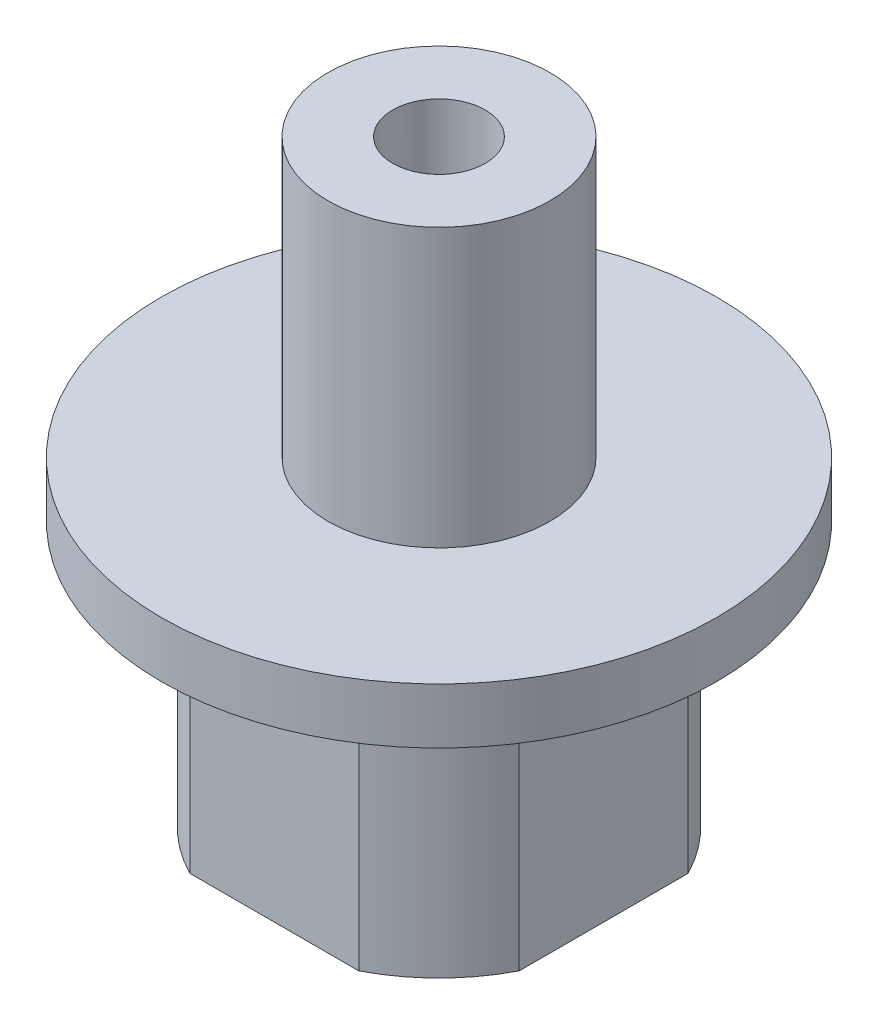
ISO-10303-21;
HEADER;
FILE_DESCRIPTION(('STEP AP214'),'2;1');
FILE_NAME('part.step','',(''),(''),'','','');
FILE_SCHEMA(('AUTOMOTIVE_DESIGN { 1 0 10303 214 1 1 1 1 }'));
ENDSEC;
DATA;
#1=APPLICATION_CONTEXT('core data for automotive mechanical design processes');
#2=APPLICATION_PROTOCOL_DEFINITION('international standard','automotive_design',2000,#1);
#3=PRODUCT_CONTEXT('',#1,'mechanical');
#4=PRODUCT('Part','Part','',(#3));
#5=PRODUCT_RELATED_PRODUCT_CATEGORY('part','',(#4));
#6=PRODUCT_DEFINITION_FORMATION('','',#4);
#7=PRODUCT_DEFINITION_CONTEXT('part definition',#1,'design');
#8=PRODUCT_DEFINITION('design','',#6,#7);
#9=PRODUCT_DEFINITION_SHAPE('','',#8);
#10=(LENGTH_UNIT() NAMED_UNIT(*) SI_UNIT(.MILLI.,.METRE.));
#11=(NAMED_UNIT(*) PLANE_ANGLE_UNIT() SI_UNIT($,.RADIAN.));
#12=(NAMED_UNIT(*) SI_UNIT($,.STERADIAN.) SOLID_ANGLE_UNIT());
#13=UNCERTAINTY_MEASURE_WITH_UNIT(LENGTH_MEASURE(1.E-05),#10,'distance_accuracy_value','');
#14=(GEOMETRIC_REPRESENTATION_CONTEXT(3) GLOBAL_UNCERTAINTY_ASSIGNED_CONTEXT((#13)) GLOBAL_UNIT_ASSIGNED_CONTEXT((#10,
#11,#12)) REPRESENTATION_CONTEXT('',''));
#15=CARTESIAN_POINT('',(0.,0.,0.));
#16=DIRECTION('',(0.,0.,1.));
#17=DIRECTION('',(1.,0.,0.));
#18=AXIS2_PLACEMENT_3D('',#15,#16,#17);
#19=CARTESIAN_POINT('',(0.,12.575,0.));
#20=DIRECTION('',(0.,1.,0.));
#21=DIRECTION('',(0.,0.,1.));
#22=AXIS2_PLACEMENT_3D('',#19,#20,#21);
#23=CYLINDRICAL_SURFACE('',#22,1.24999999999999);
#24=CARTESIAN_POINT('',(0.,12.575,0.));
#25=DIRECTION('',(0.,1.,0.));
#26=DIRECTION('',(0.,0.,1.));
#27=AXIS2_PLACEMENT_3D('',#24,#25,#26);
#28=CIRCLE('',#27,1.24999999999999);
#29=CARTESIAN_POINT('',(0.,12.575,1.24999999999999));
#30=VERTEX_POINT('',#29);
#31=EDGE_CURVE('E216',#30,#30,#28,.T.);
#32=ORIENTED_EDGE('',*,*,#31,.T.);
#33=EDGE_LOOP('',(#32));
#34=FACE_BOUND('',#33,.T.);
#35=CARTESIAN_POINT('',(0.,7.075,0.));
#36=DIRECTION('',(0.,-1.,0.));
#37=DIRECTION('',(0.,0.,-1.));
#38=AXIS2_PLACEMENT_3D('',#35,#36,#37);
#39=CIRCLE('',#38,1.24999999999999);
#40=CARTESIAN_POINT('',(0.,7.075,-1.24999999999999));
#41=VERTEX_POINT('',#40);
#42=EDGE_CURVE('E211',#41,#41,#39,.T.);
#43=ORIENTED_EDGE('',*,*,#42,.T.);
#44=EDGE_LOOP('',(#43));
#45=FACE_BOUND('',#44,.T.);
#46=ADVANCED_FACE('F47',(#34,#45),#23,.F.);
#47=CARTESIAN_POINT('',(0.,3.575,0.));
#48=DIRECTION('',(0.,-1.,0.));
#49=DIRECTION('',(0.,0.,-1.));
#50=AXIS2_PLACEMENT_3D('',#47,#48,#49);
#51=CYLINDRICAL_SURFACE('',#50,2.);
#52=CARTESIAN_POINT('',(0.,-3.575,0.));
#53=DIRECTION('',(0.,1.,0.));
#54=DIRECTION('',(0.,0.,1.));
#55=AXIS2_PLACEMENT_3D('',#52,#53,#54);
#56=CIRCLE('',#55,2.);
#57=CARTESIAN_POINT('',(0.,-3.575,2.));
#58=VERTEX_POINT('',#57);
#59=EDGE_CURVE('E135',#58,#58,#56,.T.);
#60=ORIENTED_EDGE('',*,*,#59,.F.);
#61=EDGE_LOOP('',(#60));
#62=FACE_BOUND('',#61,.T.);
#63=CARTESIAN_POINT('',(0.,0.674999999999993,-2.));
#64=CARTESIAN_POINT('',(-0.0635104730002023,0.674995650001213,-1.99999595305313));
#65=CARTESIAN_POINT('',(-0.127096441053757,0.670126988182182,-1.99694323311001));
#66=CARTESIAN_POINT('',(-0.252318262265281,0.650914196570489,-1.98502167724102));
#67=CARTESIAN_POINT('',(-0.313950163299071,0.636552006074511,-1.97614175574896));
#68=CARTESIAN_POINT('',(-0.43320555813678,0.59918863683794,-1.95345852982134));
#69=CARTESIAN_POINT('',(-0.490847243665014,0.576230212159114,-1.93967960778663));
#70=CARTESIAN_POINT('',(-0.601260368868357,0.522614149203242,-1.90834598486073));
#71=CARTESIAN_POINT('',(-0.654032347276149,0.491957363990803,-1.89079170235271));
#72=CARTESIAN_POINT('',(-0.75797419216797,0.421113426815021,-1.85170152902273));
#73=CARTESIAN_POINT('',(-0.808679560769973,0.380360700024544,-1.82995962224617));
#74=CARTESIAN_POINT('',(-0.902986375146755,0.291780825493443,-1.78531349913632));
#75=CARTESIAN_POINT('',(-0.946578107215729,0.243944171742058,-1.76240774858553));
#76=CARTESIAN_POINT('',(-1.03142873237132,0.13496610579548,-1.71430418655199));
#77=CARTESIAN_POINT('',(-1.0715720602915,0.0729002133927195,-1.68921610993413));
#78=CARTESIAN_POINT('',(-1.14073966020039,-0.0585648154471886,-1.64330198128731));
#79=CARTESIAN_POINT('',(-1.16978270899534,-0.127951312576082,-1.62246875996239));
#80=CARTESIAN_POINT('',(-1.2093340058598,-0.25381052377872,-1.59309575627365));
#81=CARTESIAN_POINT('',(-1.22269552371393,-0.308966818538819,-1.58276905990074));
#82=CARTESIAN_POINT('',(-1.24181843585479,-0.421305925610798,-1.56781357325806));
#83=CARTESIAN_POINT('',(-1.24759056342087,-0.478485758274489,-1.56317673673693));
#84=CARTESIAN_POINT('',(-1.25118918245719,-0.593413016751121,-1.56029885782828));
#85=CARTESIAN_POINT('',(-1.2489948372785,-0.651161536462399,-1.56207458771719));
#86=CARTESIAN_POINT('',(-1.23676317046804,-0.765310103188959,-1.5717740238392));
#87=CARTESIAN_POINT('',(-1.22671956265043,-0.821709032039082,-1.57970265767111));
#88=CARTESIAN_POINT('',(-1.19968103371473,-0.930438452657477,-1.60032573121781));
#89=CARTESIAN_POINT('',(-1.18285016736896,-0.982832455684269,-1.61290715104814));
#90=CARTESIAN_POINT('',(-1.14290189820937,-1.08416118240542,-1.64145566443406));
#91=CARTESIAN_POINT('',(-1.11978227193695,-1.1330946748745,-1.65742395501354));
#92=CARTESIAN_POINT('',(-1.06294892954948,-1.23583327383274,-1.6945481599302));
#93=CARTESIAN_POINT('',(-1.0280629660117,-1.28884081012039,-1.71611591575959));
#94=CARTESIAN_POINT('',(-0.950881463002094,-1.38883027900048,-1.76005711791244));
#95=CARTESIAN_POINT('',(-0.90857830801143,-1.43580593170652,-1.78243137335976));
#96=CARTESIAN_POINT('',(-0.809519713023324,-1.53030174937039,-1.82979894916857));
#97=CARTESIAN_POINT('',(-0.751531353595326,-1.57663297425883,-1.85461531676593));
#98=CARTESIAN_POINT('',(-0.627148099593562,-1.65885089588724,-1.90028055062445));
#99=CARTESIAN_POINT('',(-0.560756523881992,-1.69474169772892,-1.92113097514764));
#100=CARTESIAN_POINT('',(-0.424883562934742,-1.75276368838142,-1.95553372961316));
#101=CARTESIAN_POINT('',(-0.355763457732365,-1.77553403998118,-1.96941976591574));
#102=CARTESIAN_POINT('',(-0.213612154574971,-1.80876492798281,-1.98984929310048));
#103=CARTESIAN_POINT('',(-0.1405866483413,-1.819242894222,-1.9964031799007));
#104=CARTESIAN_POINT('',(-0.00451561874058498,-1.82656585006119,-2.00097840540091));
#105=CARTESIAN_POINT('',(0.0584027741637879,-1.82520317795385,-2.00012161345511));
#106=CARTESIAN_POINT('',(0.182972117996312,-1.81311717157927,-1.99258901494327));
#107=CARTESIAN_POINT('',(0.244623154962735,-1.80239447490783,-1.98591360473591));
#108=CARTESIAN_POINT('',(0.362521070658191,-1.77276146330803,-1.9677405228307));
#109=CARTESIAN_POINT('',(0.418885009953205,-1.75418784320334,-1.95644170526844));
#110=CARTESIAN_POINT('',(0.527638281070989,-1.70970361072143,-1.92995684104751));
#111=CARTESIAN_POINT('',(0.580026945470715,-1.68379176974484,-1.91477014350266));
#112=CARTESIAN_POINT('',(0.685084056277257,-1.62248479400451,-1.87990012356));
#113=CARTESIAN_POINT('',(0.737246967843404,-1.58639643076176,-1.85991764817225));
#114=CARTESIAN_POINT('',(0.83514264021734,-1.50720613484718,-1.81806970001717));
#115=CARTESIAN_POINT('',(0.880868151291853,-1.46409641074545,-1.79620214826384));
#116=CARTESIAN_POINT('',(0.971474198022882,-1.36486496058734,-1.74905869713091));
#117=CARTESIAN_POINT('',(1.01526851939752,-1.30776279370521,-1.72374883414957));
#118=CARTESIAN_POINT('',(1.09280351885684,-1.18612421505574,-1.67566762748172));
#119=CARTESIAN_POINT('',(1.12655115718693,-1.121592993247,-1.65289453322336));
#120=CARTESIAN_POINT('',(1.17684772011828,-1.00030785194312,-1.61733530314592));
#121=CARTESIAN_POINT('',(1.19551895865479,-0.944759249267773,-1.6034563619378));
#122=CARTESIAN_POINT('',(1.22500108205244,-0.830606854231075,-1.58105030663768));
#123=CARTESIAN_POINT('',(1.23582424983127,-0.772007990548533,-1.57251483242606));
#124=CARTESIAN_POINT('',(1.24901383653654,-0.652909723119308,-1.56206324988732));
#125=CARTESIAN_POINT('',(1.25133186963292,-0.592401414511821,-1.56018501674569));
#126=CARTESIAN_POINT('',(1.24719778716817,-0.471869039633959,-1.56349063109848));
#127=CARTESIAN_POINT('',(1.24074275650142,-0.411845140990482,-1.56867682595586));
#128=CARTESIAN_POINT('',(1.22038272403399,-0.298970204948636,-1.58455388771335));
#129=CARTESIAN_POINT('',(1.20711919499769,-0.245930698583585,-1.59476808051061));
#130=CARTESIAN_POINT('',(1.17417623469512,-0.14286494041409,-1.61917530435691));
#131=CARTESIAN_POINT('',(1.15449412799406,-0.0928399554624931,-1.63336999423728));
#132=CARTESIAN_POINT('',(1.10602690439617,0.0105967438727017,-1.66663902886519));
#133=CARTESIAN_POINT('',(1.07633644455459,0.0634502984765545,-1.68612230498997));
#134=CARTESIAN_POINT('',(1.01000017036389,0.163938367246006,-1.72667706411868));
#135=CARTESIAN_POINT('',(0.973348732866934,0.211568612560481,-1.74774982276826));
#136=CARTESIAN_POINT('',(0.885670221416053,0.310014254977841,-1.79401910731182));
#137=CARTESIAN_POINT('',(0.833233674246788,0.359590845445481,-1.81920541808777));
#138=CARTESIAN_POINT('',(0.719822446025197,0.449494829705241,-1.86698729056748));
#139=CARTESIAN_POINT('',(0.658842515138542,0.489816495927398,-1.88958124364395));
#140=CARTESIAN_POINT('',(0.5293553998914,0.559771130124097,-1.92986710976548));
#141=CARTESIAN_POINT('',(0.460835727056563,0.58938600540584,-1.94755071355357));
#142=CARTESIAN_POINT('',(0.318394712729492,0.636071884331741,-1.97581521637843));
#143=CARTESIAN_POINT('',(0.244493501106844,0.653187234869776,-1.98642121428689));
#144=CARTESIAN_POINT('',(0.141418481224659,0.667299209162624,-1.99519472168143));
#145=CARTESIAN_POINT('',(0.113248608862865,0.670181865333965,-1.99699172226301));
#146=CARTESIAN_POINT('',(0.0567241864870874,0.674033291537596,-1.9993953021324));
#147=CARTESIAN_POINT('',(0.0283696251514515,0.675001943109987,-2.00000180773911));
#148=CARTESIAN_POINT('',(0.,0.674999999999993,-2.));
#149=B_SPLINE_CURVE_WITH_KNOTS('',3,(#63,#64,#65,#66,#67,#68,#69,#70,#71,#72,#73,#74,#75,#76,
#77,#78,#79,#80,#81,#82,#83,#84,#85,#86,#87,#88,#89,#90,#91,#92,#93,#94,#95,#96,#97,#98,#99,
#100,#101,#102,#103,#104,#105,#106,#107,#108,#109,#110,#111,#112,#113,#114,#115,#116,#117,#118,
#119,#120,#121,#122,#123,#124,#125,#126,#127,#128,#129,#130,#131,#132,#133,#134,#135,#136,#137,
#138,#139,#140,#141,#142,#143,#144,#145,#146,#147,#148),.UNSPECIFIED.,.T.,.F.,(4,2,2,2,2,2,2,2,
2,2,2,2,2,2,2,2,2,2,2,2,2,2,2,2,2,2,2,2,2,2,2,2,2,2,2,2,2,2,2,2,2,2,4),(0.,0.190412301434132,
0.38118789412846,0.571026987595133,0.760845054038792,0.965821870536214,1.17107628325701,
1.40412975852973,1.6367872460701,1.80912008879716,1.9812089470739,2.15374823498777,
2.32642584505082,2.49515839460435,2.66395067908032,2.86427450354358,3.0648052257518,
3.2984218069952,3.5319464072786,3.75284174135957,3.97342347958129,4.16127180597571,
4.34910733732279,4.52959504531296,4.71011298928464,4.9088523099055,5.10781368827684,
5.33565708863711,5.56334227196908,5.74329940313717,5.92297427413349,6.10366974688198,
6.28442527563861,6.45063169037738,6.61690747313439,6.80725523036975,6.99775741153766,
7.22600539035108,7.45439424578496,7.68316725607074,7.91112460944404,7.99617501232476,
8.08123067890584),.UNSPECIFIED.);
#150=CARTESIAN_POINT('',(0.,0.674999999999993,-2.));
#151=VERTEX_POINT('',#150);
#152=EDGE_CURVE('E166',#151,#151,#149,.T.);
#153=ORIENTED_EDGE('',*,*,#152,.F.);
#154=EDGE_LOOP('',(#153));
#155=FACE_BOUND('',#154,.T.);
#156=CARTESIAN_POINT('',(0.,7.075,0.));
#157=DIRECTION('',(0.,-1.,0.));
#158=DIRECTION('',(0.,0.,-1.));
#159=AXIS2_PLACEMENT_3D('',#156,#157,#158);
#160=CIRCLE('',#159,2.);
#161=CARTESIAN_POINT('',(0.,7.075,-2.));
#162=VERTEX_POINT('',#161);
#163=EDGE_CURVE('E214',#162,#162,#160,.T.);
#164=ORIENTED_EDGE('',*,*,#163,.F.);
#165=EDGE_LOOP('',(#164));
#166=FACE_BOUND('',#165,.T.);
#167=ADVANCED_FACE('F201',(#62,#155,#166),#51,.F.);
#168=CARTESIAN_POINT('',(0.,5.075,0.));
#169=DIRECTION('',(0.,1.,0.));
#170=DIRECTION('',(0.,0.,1.));
#171=AXIS2_PLACEMENT_3D('',#168,#169,#170);
#172=PLANE('',#171);
#173=CARTESIAN_POINT('',(0.,5.075,0.));
#174=DIRECTION('',(0.,1.,0.));
#175=DIRECTION('',(0.,0.,1.));
#176=AXIS2_PLACEMENT_3D('',#173,#174,#175);
#177=CIRCLE('',#176,7.5);
#178=CARTESIAN_POINT('',(0.,5.075,7.5));
#179=VERTEX_POINT('',#178);
#180=EDGE_CURVE('E139',#179,#179,#177,.T.);
#181=ORIENTED_EDGE('',*,*,#180,.T.);
#182=EDGE_LOOP('',(#181));
#183=FACE_BOUND('',#182,.T.);
#184=CARTESIAN_POINT('',(0.,5.075,0.));
#185=DIRECTION('',(0.,1.,0.));
#186=DIRECTION('',(0.,0.,1.));
#187=AXIS2_PLACEMENT_3D('',#184,#185,#186);
#188=CIRCLE('',#187,3.);
#189=CARTESIAN_POINT('',(0.,5.075,3.));
#190=VERTEX_POINT('',#189);
#191=EDGE_CURVE('E219',#190,#190,#188,.T.);
#192=ORIENTED_EDGE('',*,*,#191,.F.);
#193=EDGE_LOOP('',(#192));
#194=FACE_BOUND('',#193,.T.);
#195=ADVANCED_FACE('F229',(#183,#194),#172,.T.);
#196=CARTESIAN_POINT('',(0.,-3.575,0.));
#197=DIRECTION('',(0.,1.,0.));
#198=DIRECTION('',(0.,0.,1.));
#199=AXIS2_PLACEMENT_3D('',#196,#197,#198);
#200=PLANE('',#199);
#201=ORIENTED_EDGE('',*,*,#59,.T.);
#202=EDGE_LOOP('',(#201));
#203=FACE_BOUND('',#202,.T.);
#204=DIRECTION('',(0.,0.,1.));
#205=VECTOR('',#204,1.);
#206=CARTESIAN_POINT('',(4.44902497867853,-3.575,-4.44902497867853));
#207=LINE('',#206,#205);
#208=CARTESIAN_POINT('',(4.44902497867853,-3.575,-2.28170478789315));
#209=VERTEX_POINT('',#208);
#210=CARTESIAN_POINT('',(4.44902497867853,-3.575,2.28170478789315));
#211=VERTEX_POINT('',#210);
#212=EDGE_CURVE('E162',#209,#211,#207,.T.);
#213=ORIENTED_EDGE('',*,*,#212,.T.);
#214=CARTESIAN_POINT('',(0.,-3.575,0.));
#215=DIRECTION('',(0.,1.,0.));
#216=DIRECTION('',(0.,0.,1.));
#217=AXIS2_PLACEMENT_3D('',#214,#215,#216);
#218=CIRCLE('',#217,5.);
#219=CARTESIAN_POINT('',(2.28170478789315,-3.575,4.44902497867853));
#220=VERTEX_POINT('',#219);
#221=EDGE_CURVE('E51',#220,#211,#218,.T.);
#222=ORIENTED_EDGE('',*,*,#221,.F.);
#223=DIRECTION('',(-1.,0.,0.));
#224=VECTOR('',#223,1.);
#225=CARTESIAN_POINT('',(-4.44902497867853,-3.575,4.44902497867853));
#226=LINE('',#225,#224);
#227=CARTESIAN_POINT('',(-2.28170478789315,-3.575,4.44902497867853));
#228=VERTEX_POINT('',#227);
#229=EDGE_CURVE('E120',#220,#228,#226,.T.);
#230=ORIENTED_EDGE('',*,*,#229,.T.);
#231=CARTESIAN_POINT('',(-4.44902497867853,-3.575,2.28170478789315));
#232=VERTEX_POINT('',#231);
#233=EDGE_CURVE('E138',#232,#228,#218,.T.);
#234=ORIENTED_EDGE('',*,*,#233,.F.);
#235=DIRECTION('',(0.,0.,-1.));
#236=VECTOR('',#235,1.);
#237=CARTESIAN_POINT('',(-4.44902497867853,-3.575,-4.44902497867853));
#238=LINE('',#237,#236);
#239=CARTESIAN_POINT('',(-4.44902497867853,-3.575,-2.28170478789315));
#240=VERTEX_POINT('',#239);
#241=EDGE_CURVE('E169',#232,#240,#238,.T.);
#242=ORIENTED_EDGE('',*,*,#241,.T.);
#243=CARTESIAN_POINT('',(-2.28170478789315,-3.575,-4.44902497867853));
#244=VERTEX_POINT('',#243);
#245=EDGE_CURVE('E286',#244,#240,#218,.T.);
#246=ORIENTED_EDGE('',*,*,#245,.F.);
#247=DIRECTION('',(1.,0.,0.));
#248=VECTOR('',#247,1.);
#249=CARTESIAN_POINT('',(-4.44902497867853,-3.575,-4.44902497867853));
#250=LINE('',#249,#248);
#251=CARTESIAN_POINT('',(2.28170478789315,-3.575,-4.44902497867853));
#252=VERTEX_POINT('',#251);
#253=EDGE_CURVE('E165',#244,#252,#250,.T.);
#254=ORIENTED_EDGE('',*,*,#253,.T.);
#255=EDGE_CURVE('E128',#209,#252,#218,.T.);
#256=ORIENTED_EDGE('',*,*,#255,.F.);
#257=EDGE_LOOP('',(#213,#222,#230,#234,#242,#246,#254,#256));
#258=FACE_BOUND('',#257,.T.);
#259=ADVANCED_FACE('F231',(#203,#258),#200,.F.);
#260=CARTESIAN_POINT('',(0.,3.575,0.));
#261=DIRECTION('',(0.,-1.,0.));
#262=DIRECTION('',(0.,0.,-1.));
#263=AXIS2_PLACEMENT_3D('',#260,#261,#262);
#264=CYLINDRICAL_SURFACE('',#263,5.);
#265=DIRECTION('',(0.,-1.,0.));
#266=VECTOR('',#265,1.);
#267=CARTESIAN_POINT('',(4.44902497867852,3.575,2.28170478789316));
#268=LINE('',#267,#266);
#269=CARTESIAN_POINT('',(4.44902497867853,3.575,2.28170478789315));
#270=VERTEX_POINT('',#269);
#271=EDGE_CURVE('E143',#270,#211,#268,.T.);
#272=ORIENTED_EDGE('',*,*,#271,.F.);
#273=CARTESIAN_POINT('',(0.,3.575,0.));
#274=DIRECTION('',(0.,1.,0.));
#275=DIRECTION('',(0.,0.,1.));
#276=AXIS2_PLACEMENT_3D('',#273,#274,#275);
#277=CIRCLE('',#276,5.);
#278=CARTESIAN_POINT('',(2.28170478789315,3.575,4.44902497867853));
#279=VERTEX_POINT('',#278);
#280=EDGE_CURVE('E11',#279,#270,#277,.T.);
#281=ORIENTED_EDGE('',*,*,#280,.F.);
#282=DIRECTION('',(0.,-1.,0.));
#283=VECTOR('',#282,1.);
#284=CARTESIAN_POINT('',(2.28170478789316,3.575,4.44902497867852));
#285=LINE('',#284,#283);
#286=EDGE_CURVE('E155',#220,#279,#285,.F.);
#287=ORIENTED_EDGE('',*,*,#286,.F.);
#288=ORIENTED_EDGE('',*,*,#221,.T.);
#289=EDGE_LOOP('',(#272,#281,#287,#288));
#290=FACE_BOUND('',#289,.T.);
#291=ADVANCED_FACE('F49',(#290),#264,.T.);
#292=DIRECTION('',(0.,-1.,0.));
#293=VECTOR('',#292,1.);
#294=CARTESIAN_POINT('',(4.44902497867852,3.575,-2.28170478789316));
#295=LINE('',#294,#293);
#296=CARTESIAN_POINT('',(4.44902497867853,3.575,-2.28170478789315));
#297=VERTEX_POINT('',#296);
#298=EDGE_CURVE('E129',#209,#297,#295,.F.);
#299=ORIENTED_EDGE('',*,*,#298,.F.);
#300=ORIENTED_EDGE('',*,*,#255,.T.);
#301=DIRECTION('',(0.,-1.,0.));
#302=VECTOR('',#301,1.);
#303=CARTESIAN_POINT('',(2.28170478789316,3.575,-4.44902497867852));
#304=LINE('',#303,#302);
#305=CARTESIAN_POINT('',(2.28170478789315,3.575,-4.44902497867853));
#306=VERTEX_POINT('',#305);
#307=EDGE_CURVE('E114',#306,#252,#304,.T.);
#308=ORIENTED_EDGE('',*,*,#307,.F.);
#309=EDGE_CURVE('E56',#297,#306,#277,.T.);
#310=ORIENTED_EDGE('',*,*,#309,.F.);
#311=EDGE_LOOP('',(#299,#300,#308,#310));
#312=FACE_BOUND('',#311,.T.);
#313=ADVANCED_FACE('F126',(#312),#264,.T.);
#314=DIRECTION('',(0.,-1.,0.));
#315=VECTOR('',#314,1.);
#316=CARTESIAN_POINT('',(-2.28170478789316,3.575,-4.44902497867852));
#317=LINE('',#316,#315);
#318=CARTESIAN_POINT('',(-2.28170478789315,3.575,-4.44902497867853));
#319=VERTEX_POINT('',#318);
#320=EDGE_CURVE('E117',#244,#319,#317,.F.);
#321=ORIENTED_EDGE('',*,*,#320,.F.);
#322=ORIENTED_EDGE('',*,*,#245,.T.);
#323=DIRECTION('',(0.,-1.,0.));
#324=VECTOR('',#323,1.);
#325=CARTESIAN_POINT('',(-4.44902497867852,3.575,-2.28170478789316));
#326=LINE('',#325,#324);
#327=CARTESIAN_POINT('',(-4.44902497867853,3.575,-2.28170478789315));
#328=VERTEX_POINT('',#327);
#329=EDGE_CURVE('E149',#328,#240,#326,.T.);
#330=ORIENTED_EDGE('',*,*,#329,.F.);
#331=EDGE_CURVE('E133',#319,#328,#277,.T.);
#332=ORIENTED_EDGE('',*,*,#331,.F.);
#333=EDGE_LOOP('',(#321,#322,#330,#332));
#334=FACE_BOUND('',#333,.T.);
#335=ADVANCED_FACE('F296',(#334),#264,.T.);
#336=DIRECTION('',(0.,-1.,0.));
#337=VECTOR('',#336,1.);
#338=CARTESIAN_POINT('',(-4.44902497867852,3.575,2.28170478789316));
#339=LINE('',#338,#337);
#340=CARTESIAN_POINT('',(-4.44902497867853,3.575,2.28170478789315));
#341=VERTEX_POINT('',#340);
#342=EDGE_CURVE('E151',#232,#341,#339,.F.);
#343=ORIENTED_EDGE('',*,*,#342,.F.);
#344=ORIENTED_EDGE('',*,*,#233,.T.);
#345=DIRECTION('',(0.,-1.,0.));
#346=VECTOR('',#345,1.);
#347=CARTESIAN_POINT('',(-2.28170478789316,3.575,4.44902497867852));
#348=LINE('',#347,#346);
#349=CARTESIAN_POINT('',(-2.28170478789315,3.575,4.44902497867853));
#350=VERTEX_POINT('',#349);
#351=EDGE_CURVE('E153',#350,#228,#348,.T.);
#352=ORIENTED_EDGE('',*,*,#351,.F.);
#353=EDGE_CURVE('E57',#341,#350,#277,.T.);
#354=ORIENTED_EDGE('',*,*,#353,.F.);
#355=EDGE_LOOP('',(#343,#344,#352,#354));
#356=FACE_BOUND('',#355,.T.);
#357=ADVANCED_FACE('F247',(#356),#264,.T.);
#358=CARTESIAN_POINT('',(0.,3.575,0.));
#359=DIRECTION('',(0.,1.,0.));
#360=DIRECTION('',(0.,0.,1.));
#361=AXIS2_PLACEMENT_3D('',#358,#359,#360);
#362=PLANE('',#361);
#363=CARTESIAN_POINT('',(0.,3.575,0.));
#364=DIRECTION('',(0.,1.,0.));
#365=DIRECTION('',(0.,0.,1.));
#366=AXIS2_PLACEMENT_3D('',#363,#364,#365);
#367=CIRCLE('',#366,7.5);
#368=CARTESIAN_POINT('',(0.,3.575,7.5));
#369=VERTEX_POINT('',#368);
#370=EDGE_CURVE('E140',#369,#369,#367,.T.);
#371=ORIENTED_EDGE('',*,*,#370,.F.);
#372=EDGE_LOOP('',(#371));
#373=FACE_BOUND('',#372,.T.);
#374=ORIENTED_EDGE('',*,*,#280,.T.);
#375=DIRECTION('',(0.,0.,1.));
#376=VECTOR('',#375,1.);
#377=CARTESIAN_POINT('',(4.44902497867853,3.575,-4.44902497867853));
#378=LINE('',#377,#376);
#379=EDGE_CURVE('E119',#297,#270,#378,.T.);
#380=ORIENTED_EDGE('',*,*,#379,.F.);
#381=ORIENTED_EDGE('',*,*,#309,.T.);
#382=DIRECTION('',(1.,0.,0.));
#383=VECTOR('',#382,1.);
#384=CARTESIAN_POINT('',(-4.44902497867853,3.575,-4.44902497867853));
#385=LINE('',#384,#383);
#386=EDGE_CURVE('E70',#319,#306,#385,.T.);
#387=ORIENTED_EDGE('',*,*,#386,.F.);
#388=ORIENTED_EDGE('',*,*,#331,.T.);
#389=DIRECTION('',(0.,0.,-1.));
#390=VECTOR('',#389,1.);
#391=CARTESIAN_POINT('',(-4.44902497867853,3.575,-4.44902497867853));
#392=LINE('',#391,#390);
#393=EDGE_CURVE('E64',#341,#328,#392,.T.);
#394=ORIENTED_EDGE('',*,*,#393,.F.);
#395=ORIENTED_EDGE('',*,*,#353,.T.);
#396=DIRECTION('',(-1.,0.,0.));
#397=VECTOR('',#396,1.);
#398=CARTESIAN_POINT('',(-4.44902497867853,3.575,4.44902497867853));
#399=LINE('',#398,#397);
#400=EDGE_CURVE('E158',#279,#350,#399,.T.);
#401=ORIENTED_EDGE('',*,*,#400,.F.);
#402=EDGE_LOOP('',(#374,#380,#381,#387,#388,#394,#395,#401));
#403=FACE_BOUND('',#402,.T.);
#404=ADVANCED_FACE('F131',(#373,#403),#362,.F.);
#405=CARTESIAN_POINT('',(0.,5.075,0.));
#406=DIRECTION('',(0.,-1.,0.));
#407=DIRECTION('',(0.,0.,-1.));
#408=AXIS2_PLACEMENT_3D('',#405,#406,#407);
#409=CYLINDRICAL_SURFACE('',#408,7.5);
#410=ORIENTED_EDGE('',*,*,#180,.F.);
#411=EDGE_LOOP('',(#410));
#412=FACE_BOUND('',#411,.T.);
#413=ORIENTED_EDGE('',*,*,#370,.T.);
#414=EDGE_LOOP('',(#413));
#415=FACE_BOUND('',#414,.T.);
#416=ADVANCED_FACE('F246',(#412,#415),#409,.T.);
#417=CARTESIAN_POINT('',(-4.44902497867853,20.3616516230558,4.44902497867853));
#418=DIRECTION('',(0.,0.,1.));
#419=DIRECTION('',(1.,0.,0.));
#420=AXIS2_PLACEMENT_3D('',#417,#418,#419);
#421=PLANE('',#420);
#422=ORIENTED_EDGE('',*,*,#351,.T.);
#423=ORIENTED_EDGE('',*,*,#229,.F.);
#424=ORIENTED_EDGE('',*,*,#286,.T.);
#425=ORIENTED_EDGE('',*,*,#400,.T.);
#426=EDGE_LOOP('',(#422,#423,#424,#425));
#427=FACE_BOUND('',#426,.T.);
#428=ADVANCED_FACE('F250',(#427),#421,.T.);
#429=CARTESIAN_POINT('',(-4.44902497867853,20.3616516230558,-4.44902497867853));
#430=DIRECTION('',(-1.,0.,0.));
#431=DIRECTION('',(0.,0.,1.));
#432=AXIS2_PLACEMENT_3D('',#429,#430,#431);
#433=PLANE('',#432);
#434=ORIENTED_EDGE('',*,*,#329,.T.);
#435=ORIENTED_EDGE('',*,*,#241,.F.);
#436=ORIENTED_EDGE('',*,*,#342,.T.);
#437=ORIENTED_EDGE('',*,*,#393,.T.);
#438=EDGE_LOOP('',(#434,#435,#436,#437));
#439=FACE_BOUND('',#438,.T.);
#440=ADVANCED_FACE('F255',(#439),#433,.T.);
#441=CARTESIAN_POINT('',(-4.44902497867853,20.3616516230558,-4.44902497867853));
#442=DIRECTION('',(0.,0.,-1.));
#443=DIRECTION('',(-1.,0.,0.));
#444=AXIS2_PLACEMENT_3D('',#441,#442,#443);
#445=PLANE('',#444);
#446=CARTESIAN_POINT('',(0.,-0.575,-4.44902497867853));
#447=DIRECTION('',(0.,0.,-1.));
#448=DIRECTION('',(-1.,0.,0.));
#449=AXIS2_PLACEMENT_3D('',#446,#447,#448);
#450=CIRCLE('',#449,1.24999999999999);
#451=CARTESIAN_POINT('',(-1.24999999999999,-0.575,-4.44902497867853));
#452=VERTEX_POINT('',#451);
#453=EDGE_CURVE('E180',#452,#452,#450,.T.);
#454=ORIENTED_EDGE('',*,*,#453,.F.);
#455=EDGE_LOOP('',(#454));
#456=FACE_BOUND('',#455,.T.);
#457=ORIENTED_EDGE('',*,*,#307,.T.);
#458=ORIENTED_EDGE('',*,*,#253,.F.);
#459=ORIENTED_EDGE('',*,*,#320,.T.);
#460=ORIENTED_EDGE('',*,*,#386,.T.);
#461=EDGE_LOOP('',(#457,#458,#459,#460));
#462=FACE_BOUND('',#461,.T.);
#463=ADVANCED_FACE('F113',(#456,#462),#445,.T.);
#464=CARTESIAN_POINT('',(4.44902497867853,20.3616516230558,-4.44902497867853));
#465=DIRECTION('',(1.,0.,0.));
#466=DIRECTION('',(0.,0.,-1.));
#467=AXIS2_PLACEMENT_3D('',#464,#465,#466);
#468=PLANE('',#467);
#469=ORIENTED_EDGE('',*,*,#271,.T.);
#470=ORIENTED_EDGE('',*,*,#212,.F.);
#471=ORIENTED_EDGE('',*,*,#298,.T.);
#472=ORIENTED_EDGE('',*,*,#379,.T.);
#473=EDGE_LOOP('',(#469,#470,#471,#472));
#474=FACE_BOUND('',#473,.T.);
#475=ADVANCED_FACE('F189',(#474),#468,.T.);
#476=CARTESIAN_POINT('',(0.,-0.575,-4.44902497867853));
#477=DIRECTION('',(0.,0.,-1.));
#478=DIRECTION('',(-1.,0.,0.));
#479=AXIS2_PLACEMENT_3D('',#476,#477,#478);
#480=CYLINDRICAL_SURFACE('',#479,1.24999999999999);
#481=ORIENTED_EDGE('',*,*,#453,.T.);
#482=EDGE_LOOP('',(#481));
#483=FACE_BOUND('',#482,.T.);
#484=ORIENTED_EDGE('',*,*,#152,.T.);
#485=EDGE_LOOP('',(#484));
#486=FACE_BOUND('',#485,.T.);
#487=ADVANCED_FACE('F184',(#483,#486),#480,.F.);
#488=CARTESIAN_POINT('',(0.,12.575,0.));
#489=DIRECTION('',(0.,1.,0.));
#490=DIRECTION('',(0.,0.,1.));
#491=AXIS2_PLACEMENT_3D('',#488,#489,#490);
#492=PLANE('',#491);
#493=ORIENTED_EDGE('',*,*,#31,.F.);
#494=EDGE_LOOP('',(#493));
#495=FACE_BOUND('',#494,.T.);
#496=CARTESIAN_POINT('',(0.,12.575,0.));
#497=DIRECTION('',(0.,1.,0.));
#498=DIRECTION('',(0.,0.,1.));
#499=AXIS2_PLACEMENT_3D('',#496,#497,#498);
#500=CIRCLE('',#499,3.);
#501=CARTESIAN_POINT('',(0.,12.575,3.));
#502=VERTEX_POINT('',#501);
#503=EDGE_CURVE('E223',#502,#502,#500,.T.);
#504=ORIENTED_EDGE('',*,*,#503,.T.);
#505=EDGE_LOOP('',(#504));
#506=FACE_BOUND('',#505,.T.);
#507=ADVANCED_FACE('F188',(#495,#506),#492,.T.);
#508=CARTESIAN_POINT('',(0.,12.575,0.));
#509=DIRECTION('',(0.,-1.,0.));
#510=DIRECTION('',(0.,0.,-1.));
#511=AXIS2_PLACEMENT_3D('',#508,#509,#510);
#512=CYLINDRICAL_SURFACE('',#511,3.);
#513=ORIENTED_EDGE('',*,*,#503,.F.);
#514=EDGE_LOOP('',(#513));
#515=FACE_BOUND('',#514,.T.);
#516=ORIENTED_EDGE('',*,*,#191,.T.);
#517=EDGE_LOOP('',(#516));
#518=FACE_BOUND('',#517,.T.);
#519=ADVANCED_FACE('F191',(#515,#518),#512,.T.);
#520=CARTESIAN_POINT('',(0.,7.075,0.));
#521=DIRECTION('',(0.,-1.,0.));
#522=DIRECTION('',(0.,0.,-1.));
#523=AXIS2_PLACEMENT_3D('',#520,#521,#522);
#524=PLANE('',#523);
#525=ORIENTED_EDGE('',*,*,#42,.F.);
#526=EDGE_LOOP('',(#525));
#527=FACE_BOUND('',#526,.T.);
#528=ORIENTED_EDGE('',*,*,#163,.T.);
#529=EDGE_LOOP('',(#528));
#530=FACE_BOUND('',#529,.T.);
#531=ADVANCED_FACE('F194',(#527,#530),#524,.T.);
#532=CLOSED_SHELL('',(#46,#167,#195,#259,#291,#313,#335,#357,#404,#416,#428,#440,#463,#475,#487,
#507,#519,#531));
#533=MANIFOLD_SOLID_BREP('B2',#532);
#534=ADVANCED_BREP_SHAPE_REPRESENTATION('',(#18,#533),#14);
#535=SHAPE_DEFINITION_REPRESENTATION(#9,#534);
ENDSEC;
END-ISO-10303-21;
